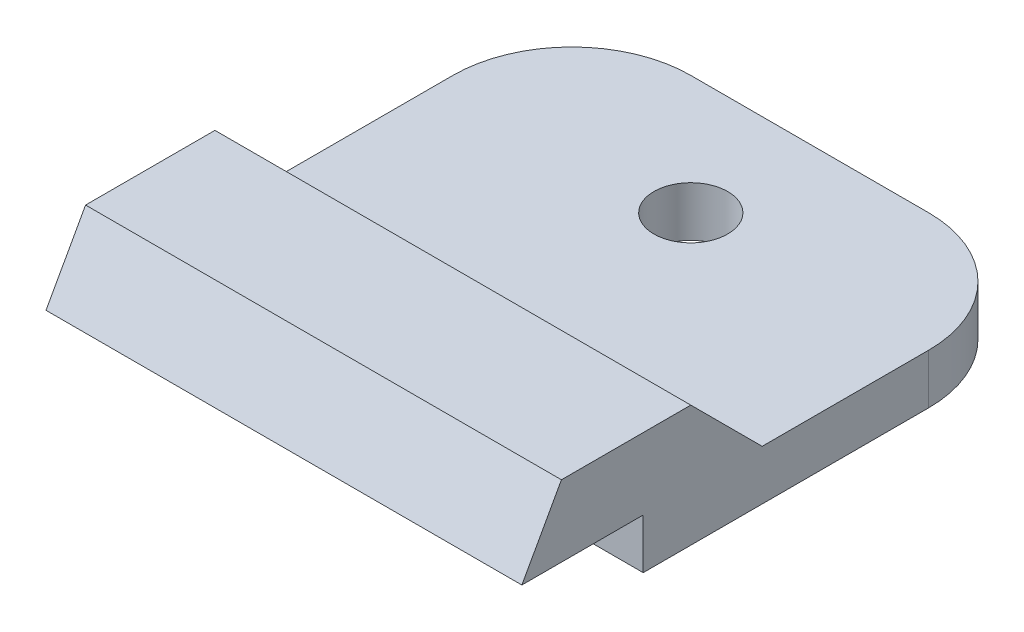
ISO-10303-21;
HEADER;
FILE_DESCRIPTION(('STEP AP214'),'2;1');
FILE_NAME('part.step','',(''),(''),'','','');
FILE_SCHEMA(('AUTOMOTIVE_DESIGN { 1 0 10303 214 1 1 1 1 }'));
ENDSEC;
DATA;
#1=APPLICATION_CONTEXT('core data for automotive mechanical design processes');
#2=APPLICATION_PROTOCOL_DEFINITION('international standard','automotive_design',2000,#1);
#3=PRODUCT_CONTEXT('',#1,'mechanical');
#4=PRODUCT('Part','Part','',(#3));
#5=PRODUCT_RELATED_PRODUCT_CATEGORY('part','',(#4));
#6=PRODUCT_DEFINITION_FORMATION('','',#4);
#7=PRODUCT_DEFINITION_CONTEXT('part definition',#1,'design');
#8=PRODUCT_DEFINITION('design','',#6,#7);
#9=PRODUCT_DEFINITION_SHAPE('','',#8);
#10=(LENGTH_UNIT() NAMED_UNIT(*) SI_UNIT(.MILLI.,.METRE.));
#11=(NAMED_UNIT(*) PLANE_ANGLE_UNIT() SI_UNIT($,.RADIAN.));
#12=(NAMED_UNIT(*) SI_UNIT($,.STERADIAN.) SOLID_ANGLE_UNIT());
#13=UNCERTAINTY_MEASURE_WITH_UNIT(LENGTH_MEASURE(1.E-05),#10,'distance_accuracy_value','');
#14=(GEOMETRIC_REPRESENTATION_CONTEXT(3) GLOBAL_UNCERTAINTY_ASSIGNED_CONTEXT((#13)) GLOBAL_UNIT_ASSIGNED_CONTEXT((#10,
#11,#12)) REPRESENTATION_CONTEXT('',''));
#15=CARTESIAN_POINT('',(0.,0.,0.));
#16=DIRECTION('',(0.,0.,1.));
#17=DIRECTION('',(1.,0.,0.));
#18=AXIS2_PLACEMENT_3D('',#15,#16,#17);
#19=CARTESIAN_POINT('',(20.,0.,0.));
#20=DIRECTION('',(0.,1.,0.));
#21=DIRECTION('',(0.,0.,1.));
#22=AXIS2_PLACEMENT_3D('',#19,#20,#21);
#23=PLANE('',#22);
#24=DIRECTION('',(0.,0.,-1.));
#25=VECTOR('',#24,1.);
#26=CARTESIAN_POINT('',(0.,0.,0.));
#27=LINE('',#26,#25);
#28=CARTESIAN_POINT('',(0.,0.,-1.66292715435831));
#29=VERTEX_POINT('',#28);
#30=CARTESIAN_POINT('',(0.,0.,-7.1));
#31=VERTEX_POINT('',#30);
#32=EDGE_CURVE('E185',#29,#31,#27,.T.);
#33=ORIENTED_EDGE('',*,*,#32,.F.);
#34=DIRECTION('',(1.,0.,0.));
#35=VECTOR('',#34,1.);
#36=CARTESIAN_POINT('',(20.,0.,-1.66292715435831));
#37=LINE('',#36,#35);
#38=CARTESIAN_POINT('',(20.,0.,-1.66292715435831));
#39=VERTEX_POINT('',#38);
#40=EDGE_CURVE('E52',#29,#39,#37,.T.);
#41=ORIENTED_EDGE('',*,*,#40,.T.);
#42=DIRECTION('',(0.,0.,-1.));
#43=VECTOR('',#42,1.);
#44=CARTESIAN_POINT('',(20.,0.,0.));
#45=LINE('',#44,#43);
#46=CARTESIAN_POINT('',(20.,0.,-7.1));
#47=VERTEX_POINT('',#46);
#48=EDGE_CURVE('E117',#39,#47,#45,.T.);
#49=ORIENTED_EDGE('',*,*,#48,.T.);
#50=DIRECTION('',(-1.,0.,0.));
#51=VECTOR('',#50,1.);
#52=CARTESIAN_POINT('',(20.,0.,-7.1));
#53=LINE('',#52,#51);
#54=EDGE_CURVE('E120',#47,#31,#53,.T.);
#55=ORIENTED_EDGE('',*,*,#54,.T.);
#56=EDGE_LOOP('',(#33,#41,#49,#55));
#57=FACE_BOUND('',#56,.T.);
#58=ADVANCED_FACE('F42',(#57),#23,.T.);
#59=CARTESIAN_POINT('',(20.,-3.,0.));
#60=DIRECTION('',(0.,1.,0.));
#61=DIRECTION('',(0.,0.,1.));
#62=AXIS2_PLACEMENT_3D('',#59,#60,#61);
#63=PLANE('',#62);
#64=DIRECTION('',(0.,0.,-1.));
#65=VECTOR('',#64,1.);
#66=CARTESIAN_POINT('',(0.,-3.,0.));
#67=LINE('',#66,#65);
#68=CARTESIAN_POINT('',(0.,-3.,0.));
#69=VERTEX_POINT('',#68);
#70=CARTESIAN_POINT('',(0.,-3.,-5.1));
#71=VERTEX_POINT('',#70);
#72=EDGE_CURVE('E222',#69,#71,#67,.T.);
#73=ORIENTED_EDGE('',*,*,#72,.T.);
#74=DIRECTION('',(-1.,0.,0.));
#75=VECTOR('',#74,1.);
#76=CARTESIAN_POINT('',(20.,-3.,-5.1));
#77=LINE('',#76,#75);
#78=CARTESIAN_POINT('',(20.,-3.,-5.1));
#79=VERTEX_POINT('',#78);
#80=EDGE_CURVE('E150',#79,#71,#77,.T.);
#81=ORIENTED_EDGE('',*,*,#80,.F.);
#82=DIRECTION('',(0.,0.,-1.));
#83=VECTOR('',#82,1.);
#84=CARTESIAN_POINT('',(20.,-3.,0.));
#85=LINE('',#84,#83);
#86=CARTESIAN_POINT('',(20.,-3.,0.));
#87=VERTEX_POINT('',#86);
#88=EDGE_CURVE('E124',#87,#79,#85,.T.);
#89=ORIENTED_EDGE('',*,*,#88,.F.);
#90=DIRECTION('',(-1.,0.,0.));
#91=VECTOR('',#90,1.);
#92=CARTESIAN_POINT('',(20.,-3.,0.));
#93=LINE('',#92,#91);
#94=EDGE_CURVE('E142',#87,#69,#93,.T.);
#95=ORIENTED_EDGE('',*,*,#94,.T.);
#96=EDGE_LOOP('',(#73,#81,#89,#95));
#97=FACE_BOUND('',#96,.T.);
#98=ADVANCED_FACE('F265',(#97),#63,.F.);
#99=CARTESIAN_POINT('',(20.,0.,-5.1));
#100=DIRECTION('',(0.,0.,-1.));
#101=DIRECTION('',(-1.,0.,0.));
#102=AXIS2_PLACEMENT_3D('',#99,#100,#101);
#103=PLANE('',#102);
#104=DIRECTION('',(0.,-1.,0.));
#105=VECTOR('',#104,1.);
#106=CARTESIAN_POINT('',(0.,0.,-5.1));
#107=LINE('',#106,#105);
#108=CARTESIAN_POINT('',(0.,-5.1,-5.1));
#109=VERTEX_POINT('',#108);
#110=EDGE_CURVE('E196',#71,#109,#107,.T.);
#111=ORIENTED_EDGE('',*,*,#110,.T.);
#112=DIRECTION('',(-1.,0.,0.));
#113=VECTOR('',#112,1.);
#114=CARTESIAN_POINT('',(20.,-5.1,-5.1));
#115=LINE('',#114,#113);
#116=CARTESIAN_POINT('',(20.,-5.1,-5.1));
#117=VERTEX_POINT('',#116);
#118=EDGE_CURVE('E207',#117,#109,#115,.T.);
#119=ORIENTED_EDGE('',*,*,#118,.F.);
#120=DIRECTION('',(0.,-1.,0.));
#121=VECTOR('',#120,1.);
#122=CARTESIAN_POINT('',(20.,0.,-5.1));
#123=LINE('',#122,#121);
#124=EDGE_CURVE('E218',#79,#117,#123,.T.);
#125=ORIENTED_EDGE('',*,*,#124,.F.);
#126=ORIENTED_EDGE('',*,*,#80,.T.);
#127=EDGE_LOOP('',(#111,#119,#125,#126));
#128=FACE_BOUND('',#127,.T.);
#129=ADVANCED_FACE('F216',(#128),#103,.F.);
#130=CARTESIAN_POINT('',(20.,-5.1,0.));
#131=DIRECTION('',(0.,1.,0.));
#132=DIRECTION('',(0.,0.,1.));
#133=AXIS2_PLACEMENT_3D('',#130,#131,#132);
#134=PLANE('',#133);
#135=CARTESIAN_POINT('',(10.,-5.1,-17.1));
#136=DIRECTION('',(0.,1.,0.));
#137=DIRECTION('',(0.,0.,1.));
#138=AXIS2_PLACEMENT_3D('',#135,#136,#137);
#139=CIRCLE('',#138,1.55);
#140=CARTESIAN_POINT('',(10.,-5.1,-15.55));
#141=VERTEX_POINT('',#140);
#142=EDGE_CURVE('E229',#141,#141,#139,.T.);
#143=ORIENTED_EDGE('',*,*,#142,.T.);
#144=EDGE_LOOP('',(#143));
#145=FACE_BOUND('',#144,.T.);
#146=DIRECTION('',(0.,0.,-1.));
#147=VECTOR('',#146,1.);
#148=CARTESIAN_POINT('',(0.,-5.1,0.));
#149=LINE('',#148,#147);
#150=CARTESIAN_POINT('',(0.,-5.1,-17.1));
#151=VERTEX_POINT('',#150);
#152=EDGE_CURVE('E192',#109,#151,#149,.T.);
#153=ORIENTED_EDGE('',*,*,#152,.T.);
#154=CARTESIAN_POINT('',(5.,-5.1,-17.1));
#155=DIRECTION('',(0.,1.,0.));
#156=DIRECTION('',(0.,0.,1.));
#157=AXIS2_PLACEMENT_3D('',#154,#155,#156);
#158=CIRCLE('',#157,5.);
#159=CARTESIAN_POINT('',(5.,-5.1,-22.1));
#160=VERTEX_POINT('',#159);
#161=EDGE_CURVE('E156',#151,#160,#158,.F.);
#162=ORIENTED_EDGE('',*,*,#161,.T.);
#163=DIRECTION('',(-1.,0.,0.));
#164=VECTOR('',#163,1.);
#165=CARTESIAN_POINT('',(20.,-5.1,-22.1));
#166=LINE('',#165,#164);
#167=CARTESIAN_POINT('',(15.,-5.1,-22.1));
#168=VERTEX_POINT('',#167);
#169=EDGE_CURVE('E203',#168,#160,#166,.T.);
#170=ORIENTED_EDGE('',*,*,#169,.F.);
#171=CARTESIAN_POINT('',(15.,-5.1,-17.1));
#172=DIRECTION('',(0.,1.,0.));
#173=DIRECTION('',(0.,0.,1.));
#174=AXIS2_PLACEMENT_3D('',#171,#172,#173);
#175=CIRCLE('',#174,5.);
#176=CARTESIAN_POINT('',(20.,-5.1,-17.1));
#177=VERTEX_POINT('',#176);
#178=EDGE_CURVE('E147',#168,#177,#175,.F.);
#179=ORIENTED_EDGE('',*,*,#178,.T.);
#180=DIRECTION('',(0.,0.,-1.));
#181=VECTOR('',#180,1.);
#182=CARTESIAN_POINT('',(20.,-5.1,0.));
#183=LINE('',#182,#181);
#184=EDGE_CURVE('E232',#117,#177,#183,.T.);
#185=ORIENTED_EDGE('',*,*,#184,.F.);
#186=ORIENTED_EDGE('',*,*,#118,.T.);
#187=EDGE_LOOP('',(#153,#162,#170,#179,#185,#186));
#188=FACE_BOUND('',#187,.T.);
#189=ADVANCED_FACE('F260',(#145,#188),#134,.F.);
#190=CARTESIAN_POINT('',(20.,0.,-22.1));
#191=DIRECTION('',(0.,0.,-1.));
#192=DIRECTION('',(-1.,0.,0.));
#193=AXIS2_PLACEMENT_3D('',#190,#191,#192);
#194=PLANE('',#193);
#195=ORIENTED_EDGE('',*,*,#169,.T.);
#196=DIRECTION('',(0.,-1.,0.));
#197=VECTOR('',#196,1.);
#198=CARTESIAN_POINT('',(5.,-3.,-22.1));
#199=LINE('',#198,#197);
#200=CARTESIAN_POINT('',(5.,-3.,-22.1));
#201=VERTEX_POINT('',#200);
#202=EDGE_CURVE('E163',#160,#201,#199,.F.);
#203=ORIENTED_EDGE('',*,*,#202,.T.);
#204=DIRECTION('',(-1.,0.,0.));
#205=VECTOR('',#204,1.);
#206=CARTESIAN_POINT('',(20.,-3.,-22.1));
#207=LINE('',#206,#205);
#208=CARTESIAN_POINT('',(15.,-3.,-22.1));
#209=VERTEX_POINT('',#208);
#210=EDGE_CURVE('E200',#209,#201,#207,.T.);
#211=ORIENTED_EDGE('',*,*,#210,.F.);
#212=DIRECTION('',(0.,-1.,0.));
#213=VECTOR('',#212,1.);
#214=CARTESIAN_POINT('',(15.,0.,-22.1));
#215=LINE('',#214,#213);
#216=EDGE_CURVE('E159',#209,#168,#215,.T.);
#217=ORIENTED_EDGE('',*,*,#216,.T.);
#218=EDGE_LOOP('',(#195,#203,#211,#217));
#219=FACE_BOUND('',#218,.T.);
#220=ADVANCED_FACE('F252',(#219),#194,.T.);
#221=CARTESIAN_POINT('',(20.,-3.,0.));
#222=DIRECTION('',(0.,1.,0.));
#223=DIRECTION('',(0.,0.,1.));
#224=AXIS2_PLACEMENT_3D('',#221,#222,#223);
#225=PLANE('',#224);
#226=CARTESIAN_POINT('',(10.,-3.,-17.1));
#227=DIRECTION('',(0.,1.,0.));
#228=DIRECTION('',(0.,0.,1.));
#229=AXIS2_PLACEMENT_3D('',#226,#227,#228);
#230=CIRCLE('',#229,1.55);
#231=CARTESIAN_POINT('',(10.,-3.,-15.55));
#232=VERTEX_POINT('',#231);
#233=EDGE_CURVE('E243',#232,#232,#230,.T.);
#234=ORIENTED_EDGE('',*,*,#233,.F.);
#235=EDGE_LOOP('',(#234));
#236=FACE_BOUND('',#235,.T.);
#237=DIRECTION('',(0.,0.,-1.));
#238=VECTOR('',#237,1.);
#239=CARTESIAN_POINT('',(0.,-3.,0.));
#240=LINE('',#239,#238);
#241=CARTESIAN_POINT('',(0.,-3.,-10.1));
#242=VERTEX_POINT('',#241);
#243=CARTESIAN_POINT('',(0.,-3.,-17.1));
#244=VERTEX_POINT('',#243);
#245=EDGE_CURVE('E125',#242,#244,#240,.T.);
#246=ORIENTED_EDGE('',*,*,#245,.F.);
#247=DIRECTION('',(1.,0.,0.));
#248=VECTOR('',#247,1.);
#249=CARTESIAN_POINT('',(20.,-3.,-10.1));
#250=LINE('',#249,#248);
#251=CARTESIAN_POINT('',(20.,-3.,-10.1));
#252=VERTEX_POINT('',#251);
#253=EDGE_CURVE('E176',#242,#252,#250,.T.);
#254=ORIENTED_EDGE('',*,*,#253,.T.);
#255=DIRECTION('',(0.,0.,-1.));
#256=VECTOR('',#255,1.);
#257=CARTESIAN_POINT('',(20.,-3.,0.));
#258=LINE('',#257,#256);
#259=CARTESIAN_POINT('',(20.,-3.,-17.1));
#260=VERTEX_POINT('',#259);
#261=EDGE_CURVE('E132',#252,#260,#258,.T.);
#262=ORIENTED_EDGE('',*,*,#261,.T.);
#263=CARTESIAN_POINT('',(15.,-3.,-17.1));
#264=DIRECTION('',(0.,1.,0.));
#265=DIRECTION('',(0.,0.,1.));
#266=AXIS2_PLACEMENT_3D('',#263,#264,#265);
#267=CIRCLE('',#266,5.);
#268=EDGE_CURVE('E166',#260,#209,#267,.T.);
#269=ORIENTED_EDGE('',*,*,#268,.T.);
#270=ORIENTED_EDGE('',*,*,#210,.T.);
#271=CARTESIAN_POINT('',(5.,-3.,-17.1));
#272=DIRECTION('',(0.,1.,0.));
#273=DIRECTION('',(0.,0.,1.));
#274=AXIS2_PLACEMENT_3D('',#271,#272,#273);
#275=CIRCLE('',#274,5.);
#276=EDGE_CURVE('E169',#201,#244,#275,.T.);
#277=ORIENTED_EDGE('',*,*,#276,.T.);
#278=EDGE_LOOP('',(#246,#254,#262,#269,#270,#277));
#279=FACE_BOUND('',#278,.T.);
#280=ADVANCED_FACE('F187',(#236,#279),#225,.T.);
#281=CARTESIAN_POINT('',(20.,0.,0.));
#282=DIRECTION('',(1.,0.,0.));
#283=DIRECTION('',(0.,0.,-1.));
#284=AXIS2_PLACEMENT_3D('',#281,#282,#283);
#285=PLANE('',#284);
#286=ORIENTED_EDGE('',*,*,#48,.F.);
#287=DIRECTION('',(0.,-0.874619707139397,0.484809620246335));
#288=VECTOR('',#287,1.);
#289=CARTESIAN_POINT('',(20.,-0.705121103650191,-1.27207214423464));
#290=LINE('',#289,#288);
#291=EDGE_CURVE('E11',#39,#87,#290,.T.);
#292=ORIENTED_EDGE('',*,*,#291,.T.);
#293=ORIENTED_EDGE('',*,*,#88,.T.);
#294=ORIENTED_EDGE('',*,*,#124,.T.);
#295=ORIENTED_EDGE('',*,*,#184,.T.);
#296=DIRECTION('',(0.,-1.,0.));
#297=VECTOR('',#296,1.);
#298=CARTESIAN_POINT('',(20.,0.,-17.1));
#299=LINE('',#298,#297);
#300=EDGE_CURVE('E173',#177,#260,#299,.F.);
#301=ORIENTED_EDGE('',*,*,#300,.T.);
#302=ORIENTED_EDGE('',*,*,#261,.F.);
#303=DIRECTION('',(0.,-0.707106781186548,-0.707106781186547));
#304=VECTOR('',#303,1.);
#305=CARTESIAN_POINT('',(20.,0.,-7.1));
#306=LINE('',#305,#304);
#307=EDGE_CURVE('E129',#252,#47,#306,.F.);
#308=ORIENTED_EDGE('',*,*,#307,.T.);
#309=EDGE_LOOP('',(#286,#292,#293,#294,#295,#301,#302,#308));
#310=FACE_BOUND('',#309,.T.);
#311=ADVANCED_FACE('F130',(#310),#285,.T.);
#312=CARTESIAN_POINT('',(0.,0.,0.));
#313=DIRECTION('',(1.,0.,0.));
#314=DIRECTION('',(0.,0.,-1.));
#315=AXIS2_PLACEMENT_3D('',#312,#313,#314);
#316=PLANE('',#315);
#317=ORIENTED_EDGE('',*,*,#72,.F.);
#318=DIRECTION('',(0.,0.874619707139397,-0.484809620246335));
#319=VECTOR('',#318,1.);
#320=CARTESIAN_POINT('',(0.,-3.00000000000002,0.));
#321=LINE('',#320,#319);
#322=EDGE_CURVE('E66',#69,#29,#321,.T.);
#323=ORIENTED_EDGE('',*,*,#322,.T.);
#324=ORIENTED_EDGE('',*,*,#32,.T.);
#325=DIRECTION('',(0.,0.707106781186548,0.707106781186547));
#326=VECTOR('',#325,1.);
#327=CARTESIAN_POINT('',(0.,3.55,-3.55000000000001));
#328=LINE('',#327,#326);
#329=EDGE_CURVE('E136',#31,#242,#328,.F.);
#330=ORIENTED_EDGE('',*,*,#329,.T.);
#331=ORIENTED_EDGE('',*,*,#245,.T.);
#332=DIRECTION('',(0.,-1.,0.));
#333=VECTOR('',#332,1.);
#334=CARTESIAN_POINT('',(0.,-5.1,-17.1));
#335=LINE('',#334,#333);
#336=EDGE_CURVE('E141',#244,#151,#335,.T.);
#337=ORIENTED_EDGE('',*,*,#336,.T.);
#338=ORIENTED_EDGE('',*,*,#152,.F.);
#339=ORIENTED_EDGE('',*,*,#110,.F.);
#340=EDGE_LOOP('',(#317,#323,#324,#330,#331,#337,#338,#339));
#341=FACE_BOUND('',#340,.T.);
#342=ADVANCED_FACE('F184',(#341),#316,.F.);
#343=CARTESIAN_POINT('',(10.,-23.,-17.1));
#344=DIRECTION('',(0.,1.,0.));
#345=DIRECTION('',(0.,0.,1.));
#346=AXIS2_PLACEMENT_3D('',#343,#344,#345);
#347=CYLINDRICAL_SURFACE('',#346,1.55);
#348=ORIENTED_EDGE('',*,*,#233,.T.);
#349=EDGE_LOOP('',(#348));
#350=FACE_BOUND('',#349,.T.);
#351=ORIENTED_EDGE('',*,*,#142,.F.);
#352=EDGE_LOOP('',(#351));
#353=FACE_BOUND('',#352,.T.);
#354=ADVANCED_FACE('F248',(#350,#353),#347,.F.);
#355=CARTESIAN_POINT('',(5.,0.,-17.1));
#356=DIRECTION('',(0.,1.,0.));
#357=DIRECTION('',(0.,0.,1.));
#358=AXIS2_PLACEMENT_3D('',#355,#356,#357);
#359=CYLINDRICAL_SURFACE('',#358,5.);
#360=ORIENTED_EDGE('',*,*,#276,.F.);
#361=ORIENTED_EDGE('',*,*,#202,.F.);
#362=ORIENTED_EDGE('',*,*,#161,.F.);
#363=ORIENTED_EDGE('',*,*,#336,.F.);
#364=EDGE_LOOP('',(#360,#361,#362,#363));
#365=FACE_BOUND('',#364,.T.);
#366=ADVANCED_FACE('F274',(#365),#359,.T.);
#367=CARTESIAN_POINT('',(15.,0.,-17.1));
#368=DIRECTION('',(0.,-1.,0.));
#369=DIRECTION('',(0.,0.,-1.));
#370=AXIS2_PLACEMENT_3D('',#367,#368,#369);
#371=CYLINDRICAL_SURFACE('',#370,5.);
#372=ORIENTED_EDGE('',*,*,#268,.F.);
#373=ORIENTED_EDGE('',*,*,#300,.F.);
#374=ORIENTED_EDGE('',*,*,#178,.F.);
#375=ORIENTED_EDGE('',*,*,#216,.F.);
#376=EDGE_LOOP('',(#372,#373,#374,#375));
#377=FACE_BOUND('',#376,.T.);
#378=ADVANCED_FACE('F277',(#377),#371,.T.);
#379=CARTESIAN_POINT('',(20.,0.,-7.1));
#380=DIRECTION('',(0.,0.707106781186547,-0.707106781186548));
#381=DIRECTION('',(1.,0.,0.));
#382=AXIS2_PLACEMENT_3D('',#379,#380,#381);
#383=PLANE('',#382);
#384=ORIENTED_EDGE('',*,*,#307,.F.);
#385=ORIENTED_EDGE('',*,*,#253,.F.);
#386=ORIENTED_EDGE('',*,*,#329,.F.);
#387=ORIENTED_EDGE('',*,*,#54,.F.);
#388=EDGE_LOOP('',(#384,#385,#386,#387));
#389=FACE_BOUND('',#388,.T.);
#390=ADVANCED_FACE('F139',(#389),#383,.T.);
#391=CARTESIAN_POINT('',(20.,-3.00000000000002,0.));
#392=DIRECTION('',(0.,0.484809620246335,0.874619707139397));
#393=DIRECTION('',(1.,0.,0.));
#394=AXIS2_PLACEMENT_3D('',#391,#392,#393);
#395=PLANE('',#394);
#396=ORIENTED_EDGE('',*,*,#291,.F.);
#397=ORIENTED_EDGE('',*,*,#40,.F.);
#398=ORIENTED_EDGE('',*,*,#322,.F.);
#399=ORIENTED_EDGE('',*,*,#94,.F.);
#400=EDGE_LOOP('',(#396,#397,#398,#399));
#401=FACE_BOUND('',#400,.T.);
#402=ADVANCED_FACE('F45',(#401),#395,.T.);
#403=CLOSED_SHELL('',(#58,#98,#129,#189,#220,#280,#311,#342,#354,#366,#378,#390,#402));
#404=MANIFOLD_SOLID_BREP('B2',#403);
#405=ADVANCED_BREP_SHAPE_REPRESENTATION('',(#18,#404),#14);
#406=SHAPE_DEFINITION_REPRESENTATION(#9,#405);
ENDSEC;
END-ISO-10303-21;
